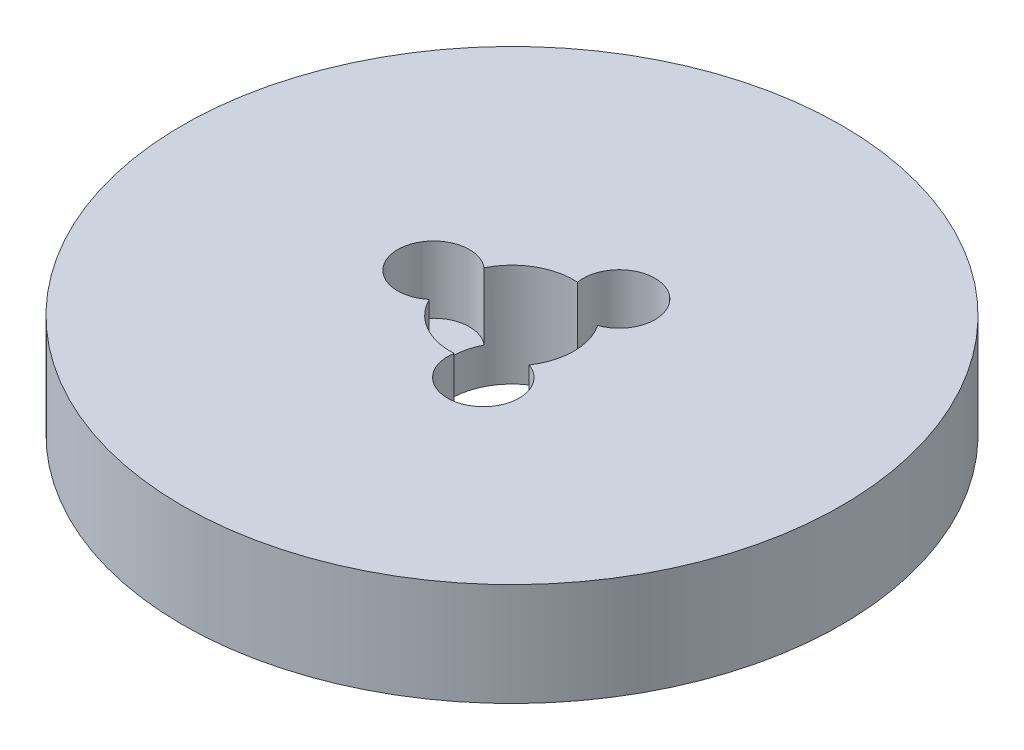
ISO-10303-21;
HEADER;
FILE_DESCRIPTION(('STEP AP214'),'2;1');
FILE_NAME('part.step','',(''),(''),'','','');
FILE_SCHEMA(('AUTOMOTIVE_DESIGN { 1 0 10303 214 1 1 1 1 }'));
ENDSEC;
DATA;
#1=APPLICATION_CONTEXT('core data for automotive mechanical design processes');
#2=APPLICATION_PROTOCOL_DEFINITION('international standard','automotive_design',2000,#1);
#3=PRODUCT_CONTEXT('',#1,'mechanical');
#4=PRODUCT('Part','Part','',(#3));
#5=PRODUCT_RELATED_PRODUCT_CATEGORY('part','',(#4));
#6=PRODUCT_DEFINITION_FORMATION('','',#4);
#7=PRODUCT_DEFINITION_CONTEXT('part definition',#1,'design');
#8=PRODUCT_DEFINITION('design','',#6,#7);
#9=PRODUCT_DEFINITION_SHAPE('','',#8);
#10=(LENGTH_UNIT() NAMED_UNIT(*) SI_UNIT(.MILLI.,.METRE.));
#11=(NAMED_UNIT(*) PLANE_ANGLE_UNIT() SI_UNIT($,.RADIAN.));
#12=(NAMED_UNIT(*) SI_UNIT($,.STERADIAN.) SOLID_ANGLE_UNIT());
#13=UNCERTAINTY_MEASURE_WITH_UNIT(LENGTH_MEASURE(1.E-05),#10,'distance_accuracy_value','');
#14=(GEOMETRIC_REPRESENTATION_CONTEXT(3) GLOBAL_UNCERTAINTY_ASSIGNED_CONTEXT((#13)) GLOBAL_UNIT_ASSIGNED_CONTEXT((#10,
#11,#12)) REPRESENTATION_CONTEXT('',''));
#15=CARTESIAN_POINT('',(0.,0.,0.));
#16=DIRECTION('',(0.,0.,1.));
#17=DIRECTION('',(1.,0.,0.));
#18=AXIS2_PLACEMENT_3D('',#15,#16,#17);
#19=CARTESIAN_POINT('',(0.,25.,0.));
#20=DIRECTION('',(0.,-1.,0.));
#21=DIRECTION('',(0.,0.,-1.));
#22=AXIS2_PLACEMENT_3D('',#19,#20,#21);
#23=CYLINDRICAL_SURFACE('',#22,80.);
#24=CARTESIAN_POINT('',(0.,25.,0.));
#25=DIRECTION('',(0.,1.,0.));
#26=DIRECTION('',(0.,0.,1.));
#27=AXIS2_PLACEMENT_3D('',#24,#25,#26);
#28=CIRCLE('',#27,80.);
#29=CARTESIAN_POINT('',(0.,25.,80.));
#30=VERTEX_POINT('',#29);
#31=EDGE_CURVE('E126',#30,#30,#28,.T.);
#32=ORIENTED_EDGE('',*,*,#31,.F.);
#33=EDGE_LOOP('',(#32));
#34=FACE_BOUND('',#33,.T.);
#35=CARTESIAN_POINT('',(0.,0.,0.));
#36=DIRECTION('',(0.,1.,0.));
#37=DIRECTION('',(0.,0.,1.));
#38=AXIS2_PLACEMENT_3D('',#35,#36,#37);
#39=CIRCLE('',#38,80.);
#40=CARTESIAN_POINT('',(0.,0.,80.));
#41=VERTEX_POINT('',#40);
#42=EDGE_CURVE('E124',#41,#41,#39,.T.);
#43=ORIENTED_EDGE('',*,*,#42,.T.);
#44=EDGE_LOOP('',(#43));
#45=FACE_BOUND('',#44,.T.);
#46=ADVANCED_FACE('F39',(#34,#45),#23,.T.);
#47=CARTESIAN_POINT('',(0.,25.,0.));
#48=DIRECTION('',(0.,1.,0.));
#49=DIRECTION('',(0.,0.,1.));
#50=AXIS2_PLACEMENT_3D('',#47,#48,#49);
#51=PLANE('',#50);
#52=CARTESIAN_POINT('',(9.52052268133773,25.,16.4900289986886));
#53=DIRECTION('',(0.,1.,0.));
#54=DIRECTION('',(0.866025403784436,0.,-0.500000000000004));
#55=AXIS2_PLACEMENT_3D('',#52,#53,#54);
#56=CIRCLE('',#55,8.70794794458617);
#57=CARTESIAN_POINT('',(0.946244455172336,25.,14.9701242957784));
#58=VERTEX_POINT('',#57);
#59=CARTESIAN_POINT('',(12.4913857103687,25.,8.30453388425851));
#60=VERTEX_POINT('',#59);
#61=EDGE_CURVE('E147',#58,#60,#56,.T.);
#62=ORIENTED_EDGE('',*,*,#61,.F.);
#63=CARTESIAN_POINT('',(0.,25.,0.));
#64=DIRECTION('',(0.,1.,0.));
#65=DIRECTION('',(0.,0.,1.));
#66=AXIS2_PLACEMENT_3D('',#63,#64,#65);
#67=CIRCLE('',#66,15.);
#68=CARTESIAN_POINT('',(-13.4376301655409,25.,6.66559041151987));
#69=VERTEX_POINT('',#68);
#70=EDGE_CURVE('E118',#69,#58,#67,.T.);
#71=ORIENTED_EDGE('',*,*,#70,.F.);
#72=CARTESIAN_POINT('',(-19.0410453626753,25.,0.));
#73=DIRECTION('',(0.,1.,0.));
#74=DIRECTION('',(0.,0.,1.));
#75=AXIS2_PLACEMENT_3D('',#72,#73,#74);
#76=CIRCLE('',#75,8.70794794458617);
#77=CARTESIAN_POINT('',(-13.4376301655409,25.,-6.66559041151987));
#78=VERTEX_POINT('',#77);
#79=EDGE_CURVE('E113',#78,#69,#76,.T.);
#80=ORIENTED_EDGE('',*,*,#79,.F.);
#81=CARTESIAN_POINT('',(0.946244455172126,25.,-14.9701242957784));
#82=VERTEX_POINT('',#81);
#83=EDGE_CURVE('E106',#82,#78,#67,.T.);
#84=ORIENTED_EDGE('',*,*,#83,.F.);
#85=CARTESIAN_POINT('',(9.52052268133749,25.,-16.4900289986888));
#86=DIRECTION('',(0.,1.,0.));
#87=DIRECTION('',(-0.866025403784443,0.,-0.499999999999992));
#88=AXIS2_PLACEMENT_3D('',#85,#86,#87);
#89=CIRCLE('',#88,8.70794794458617);
#90=CARTESIAN_POINT('',(12.4913857103685,25.,-8.30453388425868));
#91=VERTEX_POINT('',#90);
#92=EDGE_CURVE('E90',#91,#82,#89,.T.);
#93=ORIENTED_EDGE('',*,*,#92,.F.);
#94=EDGE_CURVE('E116',#60,#91,#67,.T.);
#95=ORIENTED_EDGE('',*,*,#94,.F.);
#96=EDGE_LOOP('',(#62,#71,#80,#84,#93,#95));
#97=FACE_BOUND('',#96,.T.);
#98=ORIENTED_EDGE('',*,*,#31,.T.);
#99=EDGE_LOOP('',(#98));
#100=FACE_BOUND('',#99,.T.);
#101=ADVANCED_FACE('F115',(#97,#100),#51,.T.);
#102=CARTESIAN_POINT('',(0.,0.,0.));
#103=DIRECTION('',(0.,1.,0.));
#104=DIRECTION('',(0.,0.,1.));
#105=AXIS2_PLACEMENT_3D('',#102,#103,#104);
#106=PLANE('',#105);
#107=CARTESIAN_POINT('',(0.,0.,0.));
#108=DIRECTION('',(0.,1.,0.));
#109=DIRECTION('',(0.,0.,1.));
#110=AXIS2_PLACEMENT_3D('',#107,#108,#109);
#111=CIRCLE('',#110,15.);
#112=CARTESIAN_POINT('',(0.,0.,15.));
#113=VERTEX_POINT('',#112);
#114=EDGE_CURVE('E120',#113,#113,#111,.T.);
#115=ORIENTED_EDGE('',*,*,#114,.T.);
#116=EDGE_LOOP('',(#115));
#117=FACE_BOUND('',#116,.T.);
#118=ORIENTED_EDGE('',*,*,#42,.F.);
#119=EDGE_LOOP('',(#118));
#120=FACE_BOUND('',#119,.T.);
#121=ADVANCED_FACE('F164',(#117,#120),#106,.F.);
#122=CARTESIAN_POINT('',(0.,25.,0.));
#123=DIRECTION('',(0.,-1.,0.));
#124=DIRECTION('',(0.,0.,-1.));
#125=AXIS2_PLACEMENT_3D('',#122,#123,#124);
#126=CYLINDRICAL_SURFACE('',#125,15.);
#127=DIRECTION('',(0.,1.,0.));
#128=VECTOR('',#127,1.);
#129=CARTESIAN_POINT('',(0.946244455172338,16.8781240401552,14.9701242957784));
#130=LINE('',#129,#128);
#131=CARTESIAN_POINT('',(0.946244455172336,8.7562480803104,14.9701242957784));
#132=VERTEX_POINT('',#131);
#133=EDGE_CURVE('E11',#132,#58,#130,.T.);
#134=ORIENTED_EDGE('',*,*,#133,.F.);
#135=CARTESIAN_POINT('',(0.,8.7562480803104,0.));
#136=DIRECTION('',(0.,1.,0.));
#137=DIRECTION('',(0.,0.,1.));
#138=AXIS2_PLACEMENT_3D('',#135,#136,#137);
#139=CIRCLE('',#138,15.);
#140=CARTESIAN_POINT('',(12.4913857103687,8.7562480803104,8.30453388425851));
#141=VERTEX_POINT('',#140);
#142=EDGE_CURVE('E144',#132,#141,#139,.T.);
#143=ORIENTED_EDGE('',*,*,#142,.T.);
#144=DIRECTION('',(0.,1.,0.));
#145=VECTOR('',#144,1.);
#146=CARTESIAN_POINT('',(12.4913857103687,16.8781240401552,8.30453388425851));
#147=LINE('',#146,#145);
#148=EDGE_CURVE('E46',#60,#141,#147,.F.);
#149=ORIENTED_EDGE('',*,*,#148,.F.);
#150=ORIENTED_EDGE('',*,*,#94,.T.);
#151=DIRECTION('',(0.,1.,0.));
#152=VECTOR('',#151,1.);
#153=CARTESIAN_POINT('',(12.4913857103685,16.8781240401552,-8.30453388425868));
#154=LINE('',#153,#152);
#155=CARTESIAN_POINT('',(12.4913857103685,8.7562480803104,-8.30453388425868));
#156=VERTEX_POINT('',#155);
#157=EDGE_CURVE('E92',#156,#91,#154,.T.);
#158=ORIENTED_EDGE('',*,*,#157,.F.);
#159=CARTESIAN_POINT('',(0.,8.7562480803104,0.));
#160=DIRECTION('',(0.,1.,0.));
#161=DIRECTION('',(0.,0.,1.));
#162=AXIS2_PLACEMENT_3D('',#159,#160,#161);
#163=CIRCLE('',#162,15.);
#164=CARTESIAN_POINT('',(0.946244455172126,8.7562480803104,-14.9701242957784));
#165=VERTEX_POINT('',#164);
#166=EDGE_CURVE('E107',#156,#165,#163,.T.);
#167=ORIENTED_EDGE('',*,*,#166,.T.);
#168=DIRECTION('',(0.,1.,0.));
#169=VECTOR('',#168,1.);
#170=CARTESIAN_POINT('',(0.946244455172126,16.8781240401552,-14.9701242957784));
#171=LINE('',#170,#169);
#172=EDGE_CURVE('E95',#82,#165,#171,.F.);
#173=ORIENTED_EDGE('',*,*,#172,.F.);
#174=ORIENTED_EDGE('',*,*,#83,.T.);
#175=DIRECTION('',(0.,1.,0.));
#176=VECTOR('',#175,1.);
#177=CARTESIAN_POINT('',(-13.4376301655409,16.8781240401552,-6.66559041151987));
#178=LINE('',#177,#176);
#179=CARTESIAN_POINT('',(-13.4376301655409,8.7562480803104,-6.66559041151987));
#180=VERTEX_POINT('',#179);
#181=EDGE_CURVE('E143',#180,#78,#178,.T.);
#182=ORIENTED_EDGE('',*,*,#181,.F.);
#183=CARTESIAN_POINT('',(0.,8.7562480803104,0.));
#184=DIRECTION('',(0.,1.,0.));
#185=DIRECTION('',(0.,0.,1.));
#186=AXIS2_PLACEMENT_3D('',#183,#184,#185);
#187=CIRCLE('',#186,15.);
#188=CARTESIAN_POINT('',(-13.4376301655409,8.7562480803104,6.66559041151987));
#189=VERTEX_POINT('',#188);
#190=EDGE_CURVE('E132',#180,#189,#187,.T.);
#191=ORIENTED_EDGE('',*,*,#190,.T.);
#192=DIRECTION('',(0.,1.,0.));
#193=VECTOR('',#192,1.);
#194=CARTESIAN_POINT('',(-13.4376301655409,16.8781240401552,6.66559041151987));
#195=LINE('',#194,#193);
#196=EDGE_CURVE('E137',#69,#189,#195,.F.);
#197=ORIENTED_EDGE('',*,*,#196,.F.);
#198=ORIENTED_EDGE('',*,*,#70,.T.);
#199=EDGE_LOOP('',(#134,#143,#149,#150,#158,#167,#173,#174,#182,#191,#197,#198));
#200=FACE_BOUND('',#199,.T.);
#201=ORIENTED_EDGE('',*,*,#114,.F.);
#202=EDGE_LOOP('',(#201));
#203=FACE_BOUND('',#202,.T.);
#204=ADVANCED_FACE('F103',(#200,#203),#126,.F.);
#205=CARTESIAN_POINT('',(-19.0410453626753,8.7562480803104,0.));
#206=DIRECTION('',(0.,1.,0.));
#207=DIRECTION('',(0.,0.,1.));
#208=AXIS2_PLACEMENT_3D('',#205,#206,#207);
#209=CYLINDRICAL_SURFACE('',#208,8.70794794458617);
#210=ORIENTED_EDGE('',*,*,#181,.T.);
#211=ORIENTED_EDGE('',*,*,#79,.T.);
#212=ORIENTED_EDGE('',*,*,#196,.T.);
#213=CARTESIAN_POINT('',(-19.0410453626753,8.7562480803104,0.));
#214=DIRECTION('',(0.,1.,0.));
#215=DIRECTION('',(0.,0.,1.));
#216=AXIS2_PLACEMENT_3D('',#213,#214,#215);
#217=CIRCLE('',#216,8.70794794458617);
#218=EDGE_CURVE('E121',#180,#189,#217,.T.);
#219=ORIENTED_EDGE('',*,*,#218,.F.);
#220=EDGE_LOOP('',(#210,#211,#212,#219));
#221=FACE_BOUND('',#220,.T.);
#222=ADVANCED_FACE('F174',(#221),#209,.F.);
#223=CARTESIAN_POINT('',(-19.0410453626753,8.7562480803104,0.));
#224=DIRECTION('',(0.,1.,0.));
#225=DIRECTION('',(0.,0.,1.));
#226=AXIS2_PLACEMENT_3D('',#223,#224,#225);
#227=PLANE('',#226);
#228=ORIENTED_EDGE('',*,*,#218,.T.);
#229=ORIENTED_EDGE('',*,*,#190,.F.);
#230=EDGE_LOOP('',(#228,#229));
#231=FACE_BOUND('',#230,.T.);
#232=ADVANCED_FACE('F177',(#231),#227,.T.);
#233=CARTESIAN_POINT('',(9.52052268133749,8.7562480803104,-16.4900289986888));
#234=DIRECTION('',(0.,1.,0.));
#235=DIRECTION('',(0.,0.,1.));
#236=AXIS2_PLACEMENT_3D('',#233,#234,#235);
#237=CYLINDRICAL_SURFACE('',#236,8.70794794458617);
#238=ORIENTED_EDGE('',*,*,#157,.T.);
#239=ORIENTED_EDGE('',*,*,#92,.T.);
#240=ORIENTED_EDGE('',*,*,#172,.T.);
#241=CARTESIAN_POINT('',(9.52052268133749,8.7562480803104,-16.4900289986888));
#242=DIRECTION('',(0.,1.,0.));
#243=DIRECTION('',(-0.866025403784443,0.,-0.499999999999992));
#244=AXIS2_PLACEMENT_3D('',#241,#242,#243);
#245=CIRCLE('',#244,8.70794794458617);
#246=EDGE_CURVE('E56',#156,#165,#245,.T.);
#247=ORIENTED_EDGE('',*,*,#246,.F.);
#248=EDGE_LOOP('',(#238,#239,#240,#247));
#249=FACE_BOUND('',#248,.T.);
#250=ADVANCED_FACE('F93',(#249),#237,.F.);
#251=CARTESIAN_POINT('',(9.52052268133749,8.7562480803104,-16.4900289986888));
#252=DIRECTION('',(0.,1.,0.));
#253=DIRECTION('',(-0.866025403784443,0.,-0.499999999999992));
#254=AXIS2_PLACEMENT_3D('',#251,#252,#253);
#255=PLANE('',#254);
#256=ORIENTED_EDGE('',*,*,#246,.T.);
#257=ORIENTED_EDGE('',*,*,#166,.F.);
#258=EDGE_LOOP('',(#256,#257));
#259=FACE_BOUND('',#258,.T.);
#260=ADVANCED_FACE('F160',(#259),#255,.T.);
#261=CARTESIAN_POINT('',(9.52052268133773,8.7562480803104,16.4900289986886));
#262=DIRECTION('',(0.,1.,0.));
#263=DIRECTION('',(0.,0.,1.));
#264=AXIS2_PLACEMENT_3D('',#261,#262,#263);
#265=CYLINDRICAL_SURFACE('',#264,8.70794794458617);
#266=ORIENTED_EDGE('',*,*,#133,.T.);
#267=ORIENTED_EDGE('',*,*,#61,.T.);
#268=ORIENTED_EDGE('',*,*,#148,.T.);
#269=CARTESIAN_POINT('',(9.52052268133773,8.7562480803104,16.4900289986886));
#270=DIRECTION('',(0.,1.,0.));
#271=DIRECTION('',(0.866025403784436,0.,-0.500000000000004));
#272=AXIS2_PLACEMENT_3D('',#269,#270,#271);
#273=CIRCLE('',#272,8.70794794458617);
#274=EDGE_CURVE('E55',#132,#141,#273,.T.);
#275=ORIENTED_EDGE('',*,*,#274,.F.);
#276=EDGE_LOOP('',(#266,#267,#268,#275));
#277=FACE_BOUND('',#276,.T.);
#278=ADVANCED_FACE('F149',(#277),#265,.F.);
#279=CARTESIAN_POINT('',(9.52052268133773,8.7562480803104,16.4900289986886));
#280=DIRECTION('',(0.,1.,0.));
#281=DIRECTION('',(0.866025403784436,0.,-0.500000000000004));
#282=AXIS2_PLACEMENT_3D('',#279,#280,#281);
#283=PLANE('',#282);
#284=ORIENTED_EDGE('',*,*,#274,.T.);
#285=ORIENTED_EDGE('',*,*,#142,.F.);
#286=EDGE_LOOP('',(#284,#285));
#287=FACE_BOUND('',#286,.T.);
#288=ADVANCED_FACE('F151',(#287),#283,.T.);
#289=CLOSED_SHELL('',(#46,#101,#121,#204,#222,#232,#250,#260,#278,#288));
#290=MANIFOLD_SOLID_BREP('B2',#289);
#291=ADVANCED_BREP_SHAPE_REPRESENTATION('',(#18,#290),#14);
#292=SHAPE_DEFINITION_REPRESENTATION(#9,#291);
ENDSEC;
END-ISO-10303-21;
